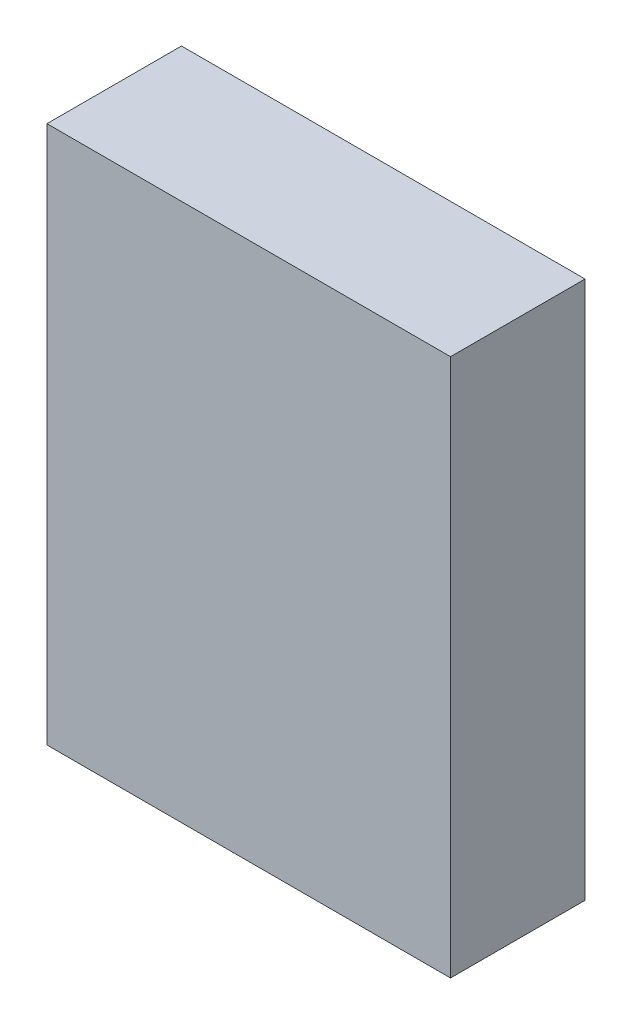
ISO-10303-21;
HEADER;
FILE_DESCRIPTION(('STEP AP214'),'2;1');
FILE_NAME('part.step','',(''),(''),'','','');
FILE_SCHEMA(('AUTOMOTIVE_DESIGN { 1 0 10303 214 1 1 1 1 }'));
ENDSEC;
DATA;
#1=APPLICATION_CONTEXT('core data for automotive mechanical design processes');
#2=APPLICATION_PROTOCOL_DEFINITION('international standard','automotive_design',2000,#1);
#3=PRODUCT_CONTEXT('',#1,'mechanical');
#4=PRODUCT('Part','Part','',(#3));
#5=PRODUCT_RELATED_PRODUCT_CATEGORY('part','',(#4));
#6=PRODUCT_DEFINITION_FORMATION('','',#4);
#7=PRODUCT_DEFINITION_CONTEXT('part definition',#1,'design');
#8=PRODUCT_DEFINITION('design','',#6,#7);
#9=PRODUCT_DEFINITION_SHAPE('','',#8);
#10=(LENGTH_UNIT() NAMED_UNIT(*) SI_UNIT(.MILLI.,.METRE.));
#11=(NAMED_UNIT(*) PLANE_ANGLE_UNIT() SI_UNIT($,.RADIAN.));
#12=(NAMED_UNIT(*) SI_UNIT($,.STERADIAN.) SOLID_ANGLE_UNIT());
#13=UNCERTAINTY_MEASURE_WITH_UNIT(LENGTH_MEASURE(1.E-05),#10,'distance_accuracy_value','');
#14=(GEOMETRIC_REPRESENTATION_CONTEXT(3) GLOBAL_UNCERTAINTY_ASSIGNED_CONTEXT((#13)) GLOBAL_UNIT_ASSIGNED_CONTEXT((#10,
#11,#12)) REPRESENTATION_CONTEXT('',''));
#15=CARTESIAN_POINT('',(0.,0.,0.));
#16=DIRECTION('',(0.,0.,1.));
#17=DIRECTION('',(1.,0.,0.));
#18=AXIS2_PLACEMENT_3D('',#15,#16,#17);
#19=CARTESIAN_POINT('',(7.5,-10.,5.));
#20=DIRECTION('',(-1.,0.,0.));
#21=DIRECTION('',(0.,0.,1.));
#22=AXIS2_PLACEMENT_3D('',#19,#20,#21);
#23=PLANE('',#22);
#24=DIRECTION('',(0.,1.,0.));
#25=VECTOR('',#24,1.);
#26=CARTESIAN_POINT('',(7.5,-10.,0.));
#27=LINE('',#26,#25);
#28=CARTESIAN_POINT('',(7.5,-10.,0.));
#29=VERTEX_POINT('',#28);
#30=CARTESIAN_POINT('',(7.5,10.,0.));
#31=VERTEX_POINT('',#30);
#32=EDGE_CURVE('E107',#29,#31,#27,.T.);
#33=ORIENTED_EDGE('',*,*,#32,.T.);
#34=DIRECTION('',(0.,0.,-1.));
#35=VECTOR('',#34,1.);
#36=CARTESIAN_POINT('',(7.5,10.,5.));
#37=LINE('',#36,#35);
#38=CARTESIAN_POINT('',(7.5,10.,5.));
#39=VERTEX_POINT('',#38);
#40=EDGE_CURVE('E11',#39,#31,#37,.T.);
#41=ORIENTED_EDGE('',*,*,#40,.F.);
#42=DIRECTION('',(0.,1.,0.));
#43=VECTOR('',#42,1.);
#44=CARTESIAN_POINT('',(7.5,-10.,5.));
#45=LINE('',#44,#43);
#46=CARTESIAN_POINT('',(7.5,-10.,5.));
#47=VERTEX_POINT('',#46);
#48=EDGE_CURVE('E91',#47,#39,#45,.T.);
#49=ORIENTED_EDGE('',*,*,#48,.F.);
#50=DIRECTION('',(0.,0.,-1.));
#51=VECTOR('',#50,1.);
#52=CARTESIAN_POINT('',(7.5,-10.,5.));
#53=LINE('',#52,#51);
#54=EDGE_CURVE('E103',#47,#29,#53,.T.);
#55=ORIENTED_EDGE('',*,*,#54,.T.);
#56=EDGE_LOOP('',(#33,#41,#49,#55));
#57=FACE_BOUND('',#56,.T.);
#58=ADVANCED_FACE('F39',(#57),#23,.F.);
#59=CARTESIAN_POINT('',(-7.5,10.,5.));
#60=DIRECTION('',(0.,-1.,0.));
#61=DIRECTION('',(1.,0.,0.));
#62=AXIS2_PLACEMENT_3D('',#59,#60,#61);
#63=PLANE('',#62);
#64=DIRECTION('',(-1.,0.,0.));
#65=VECTOR('',#64,1.);
#66=CARTESIAN_POINT('',(-7.5,10.,0.));
#67=LINE('',#66,#65);
#68=CARTESIAN_POINT('',(-7.5,10.,0.));
#69=VERTEX_POINT('',#68);
#70=EDGE_CURVE('E96',#31,#69,#67,.T.);
#71=ORIENTED_EDGE('',*,*,#70,.T.);
#72=DIRECTION('',(0.,0.,-1.));
#73=VECTOR('',#72,1.);
#74=CARTESIAN_POINT('',(-7.5,10.,5.));
#75=LINE('',#74,#73);
#76=CARTESIAN_POINT('',(-7.5,10.,5.));
#77=VERTEX_POINT('',#76);
#78=EDGE_CURVE('E48',#77,#69,#75,.T.);
#79=ORIENTED_EDGE('',*,*,#78,.F.);
#80=DIRECTION('',(-1.,0.,0.));
#81=VECTOR('',#80,1.);
#82=CARTESIAN_POINT('',(-7.5,10.,5.));
#83=LINE('',#82,#81);
#84=EDGE_CURVE('E86',#39,#77,#83,.T.);
#85=ORIENTED_EDGE('',*,*,#84,.F.);
#86=ORIENTED_EDGE('',*,*,#40,.T.);
#87=EDGE_LOOP('',(#71,#79,#85,#86));
#88=FACE_BOUND('',#87,.T.);
#89=ADVANCED_FACE('F95',(#88),#63,.F.);
#90=CARTESIAN_POINT('',(-7.5,-10.,5.));
#91=DIRECTION('',(1.,0.,0.));
#92=DIRECTION('',(0.,1.,0.));
#93=AXIS2_PLACEMENT_3D('',#90,#91,#92);
#94=PLANE('',#93);
#95=DIRECTION('',(0.,-1.,0.));
#96=VECTOR('',#95,1.);
#97=CARTESIAN_POINT('',(-7.5,-10.,0.));
#98=LINE('',#97,#96);
#99=CARTESIAN_POINT('',(-7.5,-10.,0.));
#100=VERTEX_POINT('',#99);
#101=EDGE_CURVE('E73',#69,#100,#98,.T.);
#102=ORIENTED_EDGE('',*,*,#101,.T.);
#103=DIRECTION('',(0.,0.,-1.));
#104=VECTOR('',#103,1.);
#105=CARTESIAN_POINT('',(-7.5,-10.,5.));
#106=LINE('',#105,#104);
#107=CARTESIAN_POINT('',(-7.5,-10.,5.));
#108=VERTEX_POINT('',#107);
#109=EDGE_CURVE('E98',#108,#100,#106,.T.);
#110=ORIENTED_EDGE('',*,*,#109,.F.);
#111=DIRECTION('',(0.,-1.,0.));
#112=VECTOR('',#111,1.);
#113=CARTESIAN_POINT('',(-7.5,-10.,5.));
#114=LINE('',#113,#112);
#115=EDGE_CURVE('E89',#77,#108,#114,.T.);
#116=ORIENTED_EDGE('',*,*,#115,.F.);
#117=ORIENTED_EDGE('',*,*,#78,.T.);
#118=EDGE_LOOP('',(#102,#110,#116,#117));
#119=FACE_BOUND('',#118,.T.);
#120=ADVANCED_FACE('F99',(#119),#94,.F.);
#121=CARTESIAN_POINT('',(-7.5,-10.,5.));
#122=DIRECTION('',(0.,1.,0.));
#123=DIRECTION('',(-1.,0.,0.));
#124=AXIS2_PLACEMENT_3D('',#121,#122,#123);
#125=PLANE('',#124);
#126=DIRECTION('',(1.,0.,0.));
#127=VECTOR('',#126,1.);
#128=CARTESIAN_POINT('',(-7.5,-10.,0.));
#129=LINE('',#128,#127);
#130=EDGE_CURVE('E79',#100,#29,#129,.T.);
#131=ORIENTED_EDGE('',*,*,#130,.T.);
#132=ORIENTED_EDGE('',*,*,#54,.F.);
#133=DIRECTION('',(1.,0.,0.));
#134=VECTOR('',#133,1.);
#135=CARTESIAN_POINT('',(-7.5,-10.,5.));
#136=LINE('',#135,#134);
#137=EDGE_CURVE('E56',#108,#47,#136,.T.);
#138=ORIENTED_EDGE('',*,*,#137,.F.);
#139=ORIENTED_EDGE('',*,*,#109,.T.);
#140=EDGE_LOOP('',(#131,#132,#138,#139));
#141=FACE_BOUND('',#140,.T.);
#142=ADVANCED_FACE('F120',(#141),#125,.F.);
#143=CARTESIAN_POINT('',(0.,0.,5.));
#144=DIRECTION('',(0.,0.,-1.));
#145=DIRECTION('',(-1.,0.,0.));
#146=AXIS2_PLACEMENT_3D('',#143,#144,#145);
#147=PLANE('',#146);
#148=ORIENTED_EDGE('',*,*,#48,.T.);
#149=ORIENTED_EDGE('',*,*,#84,.T.);
#150=ORIENTED_EDGE('',*,*,#115,.T.);
#151=ORIENTED_EDGE('',*,*,#137,.T.);
#152=EDGE_LOOP('',(#148,#149,#150,#151));
#153=FACE_BOUND('',#152,.T.);
#154=ADVANCED_FACE('F87',(#153),#147,.F.);
#155=CARTESIAN_POINT('',(0.,0.,0.));
#156=DIRECTION('',(0.,0.,-1.));
#157=DIRECTION('',(-1.,0.,0.));
#158=AXIS2_PLACEMENT_3D('',#155,#156,#157);
#159=PLANE('',#158);
#160=ORIENTED_EDGE('',*,*,#32,.F.);
#161=ORIENTED_EDGE('',*,*,#130,.F.);
#162=ORIENTED_EDGE('',*,*,#101,.F.);
#163=ORIENTED_EDGE('',*,*,#70,.F.);
#164=EDGE_LOOP('',(#160,#161,#162,#163));
#165=FACE_BOUND('',#164,.T.);
#166=ADVANCED_FACE('F123',(#165),#159,.T.);
#167=CLOSED_SHELL('',(#58,#89,#120,#142,#154,#166));
#168=MANIFOLD_SOLID_BREP('B2',#167);
#169=ADVANCED_BREP_SHAPE_REPRESENTATION('',(#18,#168),#14);
#170=SHAPE_DEFINITION_REPRESENTATION(#9,#169);
ENDSEC;
END-ISO-10303-21;
